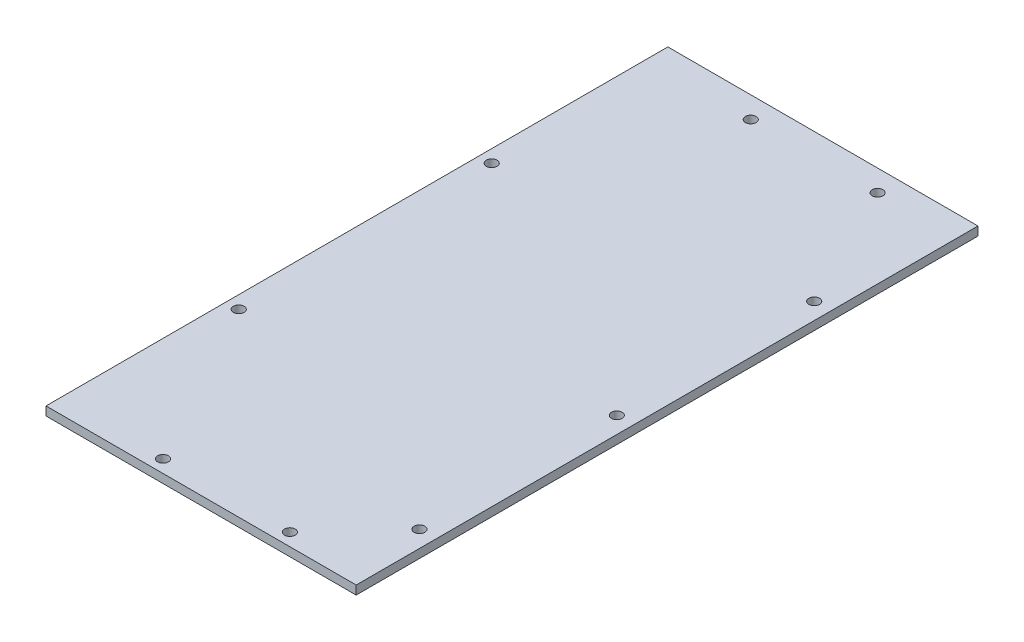
ISO-10303-21;
HEADER;
FILE_DESCRIPTION(('STEP AP214'),'2;1');
FILE_NAME('part.step','',(''),(''),'','','');
FILE_SCHEMA(('AUTOMOTIVE_DESIGN { 1 0 10303 214 1 1 1 1 }'));
ENDSEC;
DATA;
#1=APPLICATION_CONTEXT('core data for automotive mechanical design processes');
#2=APPLICATION_PROTOCOL_DEFINITION('international standard','automotive_design',2000,#1);
#3=PRODUCT_CONTEXT('',#1,'mechanical');
#4=PRODUCT('Part','Part','',(#3));
#5=PRODUCT_RELATED_PRODUCT_CATEGORY('part','',(#4));
#6=PRODUCT_DEFINITION_FORMATION('','',#4);
#7=PRODUCT_DEFINITION_CONTEXT('part definition',#1,'design');
#8=PRODUCT_DEFINITION('design','',#6,#7);
#9=PRODUCT_DEFINITION_SHAPE('','',#8);
#10=(LENGTH_UNIT() NAMED_UNIT(*) SI_UNIT(.MILLI.,.METRE.));
#11=(NAMED_UNIT(*) PLANE_ANGLE_UNIT() SI_UNIT($,.RADIAN.));
#12=(NAMED_UNIT(*) SI_UNIT($,.STERADIAN.) SOLID_ANGLE_UNIT());
#13=UNCERTAINTY_MEASURE_WITH_UNIT(LENGTH_MEASURE(1.E-05),#10,'distance_accuracy_value','');
#14=(GEOMETRIC_REPRESENTATION_CONTEXT(3) GLOBAL_UNCERTAINTY_ASSIGNED_CONTEXT((#13)) GLOBAL_UNIT_ASSIGNED_CONTEXT((#10,
#11,#12)) REPRESENTATION_CONTEXT('',''));
#15=CARTESIAN_POINT('',(0.,0.,0.));
#16=DIRECTION('',(0.,0.,1.));
#17=DIRECTION('',(1.,0.,0.));
#18=AXIS2_PLACEMENT_3D('',#15,#16,#17);
#19=CARTESIAN_POINT('',(55.,3.1,-110.26625));
#20=DIRECTION('',(-1.,0.,0.));
#21=DIRECTION('',(0.,0.,1.));
#22=AXIS2_PLACEMENT_3D('',#19,#20,#21);
#23=PLANE('',#22);
#24=DIRECTION('',(0.,0.,-1.));
#25=VECTOR('',#24,1.);
#26=CARTESIAN_POINT('',(55.,0.,-110.26625));
#27=LINE('',#26,#25);
#28=CARTESIAN_POINT('',(55.,0.,110.26625));
#29=VERTEX_POINT('',#28);
#30=CARTESIAN_POINT('',(55.,0.,-110.26625));
#31=VERTEX_POINT('',#30);
#32=EDGE_CURVE('E99',#29,#31,#27,.T.);
#33=ORIENTED_EDGE('',*,*,#32,.T.);
#34=DIRECTION('',(0.,-1.,0.));
#35=VECTOR('',#34,1.);
#36=CARTESIAN_POINT('',(55.,3.1,-110.26625));
#37=LINE('',#36,#35);
#38=CARTESIAN_POINT('',(55.,3.1,-110.26625));
#39=VERTEX_POINT('',#38);
#40=EDGE_CURVE('E11',#39,#31,#37,.T.);
#41=ORIENTED_EDGE('',*,*,#40,.F.);
#42=DIRECTION('',(0.,0.,-1.));
#43=VECTOR('',#42,1.);
#44=CARTESIAN_POINT('',(55.,3.1,-110.26625));
#45=LINE('',#44,#43);
#46=CARTESIAN_POINT('',(55.,3.1,110.26625));
#47=VERTEX_POINT('',#46);
#48=EDGE_CURVE('E87',#47,#39,#45,.T.);
#49=ORIENTED_EDGE('',*,*,#48,.F.);
#50=DIRECTION('',(0.,-1.,0.));
#51=VECTOR('',#50,1.);
#52=CARTESIAN_POINT('',(55.,3.1,110.26625));
#53=LINE('',#52,#51);
#54=EDGE_CURVE('E95',#47,#29,#53,.T.);
#55=ORIENTED_EDGE('',*,*,#54,.T.);
#56=EDGE_LOOP('',(#33,#41,#49,#55));
#57=FACE_BOUND('',#56,.T.);
#58=ADVANCED_FACE('F36',(#57),#23,.F.);
#59=CARTESIAN_POINT('',(-55.,3.1,-110.26625));
#60=DIRECTION('',(0.,0.,1.));
#61=DIRECTION('',(1.,0.,0.));
#62=AXIS2_PLACEMENT_3D('',#59,#60,#61);
#63=PLANE('',#62);
#64=DIRECTION('',(-1.,0.,0.));
#65=VECTOR('',#64,1.);
#66=CARTESIAN_POINT('',(-55.,0.,-110.26625));
#67=LINE('',#66,#65);
#68=CARTESIAN_POINT('',(-55.,0.,-110.26625));
#69=VERTEX_POINT('',#68);
#70=EDGE_CURVE('E91',#31,#69,#67,.T.);
#71=ORIENTED_EDGE('',*,*,#70,.T.);
#72=DIRECTION('',(0.,-1.,0.));
#73=VECTOR('',#72,1.);
#74=CARTESIAN_POINT('',(-55.,3.1,-110.26625));
#75=LINE('',#74,#73);
#76=CARTESIAN_POINT('',(-55.,3.1,-110.26625));
#77=VERTEX_POINT('',#76);
#78=EDGE_CURVE('E44',#77,#69,#75,.T.);
#79=ORIENTED_EDGE('',*,*,#78,.F.);
#80=DIRECTION('',(-1.,0.,0.));
#81=VECTOR('',#80,1.);
#82=CARTESIAN_POINT('',(-55.,3.1,-110.26625));
#83=LINE('',#82,#81);
#84=EDGE_CURVE('E82',#39,#77,#83,.T.);
#85=ORIENTED_EDGE('',*,*,#84,.F.);
#86=ORIENTED_EDGE('',*,*,#40,.T.);
#87=EDGE_LOOP('',(#71,#79,#85,#86));
#88=FACE_BOUND('',#87,.T.);
#89=ADVANCED_FACE('F90',(#88),#63,.F.);
#90=CARTESIAN_POINT('',(-55.,3.1,-110.26625));
#91=DIRECTION('',(1.,0.,0.));
#92=DIRECTION('',(0.,0.,-1.));
#93=AXIS2_PLACEMENT_3D('',#90,#91,#92);
#94=PLANE('',#93);
#95=DIRECTION('',(0.,0.,1.));
#96=VECTOR('',#95,1.);
#97=CARTESIAN_POINT('',(-55.,0.,-110.26625));
#98=LINE('',#97,#96);
#99=CARTESIAN_POINT('',(-55.,0.,110.26625));
#100=VERTEX_POINT('',#99);
#101=EDGE_CURVE('E69',#69,#100,#98,.T.);
#102=ORIENTED_EDGE('',*,*,#101,.T.);
#103=DIRECTION('',(0.,-1.,0.));
#104=VECTOR('',#103,1.);
#105=CARTESIAN_POINT('',(-55.,3.1,110.26625));
#106=LINE('',#105,#104);
#107=CARTESIAN_POINT('',(-55.,3.1,110.26625));
#108=VERTEX_POINT('',#107);
#109=EDGE_CURVE('E92',#108,#100,#106,.T.);
#110=ORIENTED_EDGE('',*,*,#109,.F.);
#111=DIRECTION('',(0.,0.,1.));
#112=VECTOR('',#111,1.);
#113=CARTESIAN_POINT('',(-55.,3.1,-110.26625));
#114=LINE('',#113,#112);
#115=EDGE_CURVE('E85',#77,#108,#114,.T.);
#116=ORIENTED_EDGE('',*,*,#115,.F.);
#117=ORIENTED_EDGE('',*,*,#78,.T.);
#118=EDGE_LOOP('',(#102,#110,#116,#117));
#119=FACE_BOUND('',#118,.T.);
#120=ADVANCED_FACE('F93',(#119),#94,.F.);
#121=CARTESIAN_POINT('',(-55.,3.1,110.26625));
#122=DIRECTION('',(0.,0.,-1.));
#123=DIRECTION('',(-1.,0.,0.));
#124=AXIS2_PLACEMENT_3D('',#121,#122,#123);
#125=PLANE('',#124);
#126=DIRECTION('',(1.,0.,0.));
#127=VECTOR('',#126,1.);
#128=CARTESIAN_POINT('',(-55.,0.,110.26625));
#129=LINE('',#128,#127);
#130=EDGE_CURVE('E75',#100,#29,#129,.T.);
#131=ORIENTED_EDGE('',*,*,#130,.T.);
#132=ORIENTED_EDGE('',*,*,#54,.F.);
#133=DIRECTION('',(1.,0.,0.));
#134=VECTOR('',#133,1.);
#135=CARTESIAN_POINT('',(-55.,3.1,110.26625));
#136=LINE('',#135,#134);
#137=EDGE_CURVE('E52',#108,#47,#136,.T.);
#138=ORIENTED_EDGE('',*,*,#137,.F.);
#139=ORIENTED_EDGE('',*,*,#109,.T.);
#140=EDGE_LOOP('',(#131,#132,#138,#139));
#141=FACE_BOUND('',#140,.T.);
#142=ADVANCED_FACE('F107',(#141),#125,.F.);
#143=CARTESIAN_POINT('',(0.,3.1,0.));
#144=DIRECTION('',(0.,1.,0.));
#145=DIRECTION('',(0.,0.,1.));
#146=AXIS2_PLACEMENT_3D('',#143,#144,#145);
#147=PLANE('',#146);
#148=CARTESIAN_POINT('',(27.0003,3.1,-102.66625));
#149=DIRECTION('',(0.,-1.,0.));
#150=DIRECTION('',(0.,0.,-1.));
#151=AXIS2_PLACEMENT_3D('',#148,#149,#150);
#152=CIRCLE('',#151,1.89865);
#153=CARTESIAN_POINT('',(27.0003,3.1,-104.5649));
#154=VERTEX_POINT('',#153);
#155=EDGE_CURVE('E160',#154,#154,#152,.T.);
#156=ORIENTED_EDGE('',*,*,#155,.T.);
#157=EDGE_LOOP('',(#156));
#158=FACE_BOUND('',#157,.T.);
#159=CARTESIAN_POINT('',(-17.9997,3.1,-102.66625));
#160=DIRECTION('',(0.,-1.,0.));
#161=DIRECTION('',(0.,0.,-1.));
#162=AXIS2_PLACEMENT_3D('',#159,#160,#161);
#163=CIRCLE('',#162,1.89865);
#164=CARTESIAN_POINT('',(-17.9997,3.1,-104.5649));
#165=VERTEX_POINT('',#164);
#166=EDGE_CURVE('E154',#165,#165,#163,.T.);
#167=ORIENTED_EDGE('',*,*,#166,.T.);
#168=EDGE_LOOP('',(#167));
#169=FACE_BOUND('',#168,.T.);
#170=CARTESIAN_POINT('',(27.0002999999999,3.1,105.77045));
#171=DIRECTION('',(0.,-1.,0.));
#172=DIRECTION('',(0.,0.,-1.));
#173=AXIS2_PLACEMENT_3D('',#170,#171,#172);
#174=CIRCLE('',#173,1.89865);
#175=CARTESIAN_POINT('',(27.0002999999999,3.1,103.8718));
#176=VERTEX_POINT('',#175);
#177=EDGE_CURVE('E148',#176,#176,#174,.T.);
#178=ORIENTED_EDGE('',*,*,#177,.T.);
#179=EDGE_LOOP('',(#178));
#180=FACE_BOUND('',#179,.T.);
#181=CARTESIAN_POINT('',(-17.9997,3.1,105.77045));
#182=DIRECTION('',(0.,-1.,0.));
#183=DIRECTION('',(0.,0.,-1.));
#184=AXIS2_PLACEMENT_3D('',#181,#182,#183);
#185=CIRCLE('',#184,1.89865);
#186=CARTESIAN_POINT('',(-17.9997,3.1,103.8718));
#187=VERTEX_POINT('',#186);
#188=EDGE_CURVE('E142',#187,#187,#185,.T.);
#189=ORIENTED_EDGE('',*,*,#188,.T.);
#190=EDGE_LOOP('',(#189));
#191=FACE_BOUND('',#190,.T.);
#192=CARTESIAN_POINT('',(49.0999999999999,3.1,-58.075));
#193=DIRECTION('',(0.,1.,0.));
#194=DIRECTION('',(0.,0.,1.));
#195=AXIS2_PLACEMENT_3D('',#192,#193,#194);
#196=CIRCLE('',#195,1.89864999999999);
#197=CARTESIAN_POINT('',(49.0999999999999,3.1,-56.17635));
#198=VERTEX_POINT('',#197);
#199=EDGE_CURVE('E139',#198,#198,#196,.T.);
#200=ORIENTED_EDGE('',*,*,#199,.F.);
#201=EDGE_LOOP('',(#200));
#202=FACE_BOUND('',#201,.T.);
#203=CARTESIAN_POINT('',(49.0999999999999,3.1,11.925));
#204=DIRECTION('',(0.,1.,0.));
#205=DIRECTION('',(0.,0.,1.));
#206=AXIS2_PLACEMENT_3D('',#203,#204,#205);
#207=CIRCLE('',#206,1.89864999999999);
#208=CARTESIAN_POINT('',(49.0999999999999,3.1,13.82365));
#209=VERTEX_POINT('',#208);
#210=EDGE_CURVE('E133',#209,#209,#207,.T.);
#211=ORIENTED_EDGE('',*,*,#210,.F.);
#212=EDGE_LOOP('',(#211));
#213=FACE_BOUND('',#212,.T.);
#214=CARTESIAN_POINT('',(49.0999999999999,3.1,81.925));
#215=DIRECTION('',(0.,1.,0.));
#216=DIRECTION('',(0.,0.,1.));
#217=AXIS2_PLACEMENT_3D('',#214,#215,#216);
#218=CIRCLE('',#217,1.89864999999999);
#219=CARTESIAN_POINT('',(49.0999999999999,3.1,83.82365));
#220=VERTEX_POINT('',#219);
#221=EDGE_CURVE('E127',#220,#220,#218,.T.);
#222=ORIENTED_EDGE('',*,*,#221,.F.);
#223=EDGE_LOOP('',(#222));
#224=FACE_BOUND('',#223,.T.);
#225=CARTESIAN_POINT('',(-50.4997,3.1,46.4112749999999));
#226=DIRECTION('',(0.,1.,0.));
#227=DIRECTION('',(0.,0.,1.));
#228=AXIS2_PLACEMENT_3D('',#225,#226,#227);
#229=CIRCLE('',#228,1.89864999999999);
#230=CARTESIAN_POINT('',(-50.4997,3.1,48.3099249999999));
#231=VERTEX_POINT('',#230);
#232=EDGE_CURVE('E121',#231,#231,#229,.T.);
#233=ORIENTED_EDGE('',*,*,#232,.F.);
#234=EDGE_LOOP('',(#233));
#235=FACE_BOUND('',#234,.T.);
#236=CARTESIAN_POINT('',(-50.4997,3.1,-43.3070750000001));
#237=DIRECTION('',(0.,1.,0.));
#238=DIRECTION('',(0.,0.,1.));
#239=AXIS2_PLACEMENT_3D('',#236,#237,#238);
#240=CIRCLE('',#239,1.89864999999999);
#241=CARTESIAN_POINT('',(-50.4997,3.1,-41.4084250000001));
#242=VERTEX_POINT('',#241);
#243=EDGE_CURVE('E115',#242,#242,#240,.T.);
#244=ORIENTED_EDGE('',*,*,#243,.F.);
#245=EDGE_LOOP('',(#244));
#246=FACE_BOUND('',#245,.T.);
#247=ORIENTED_EDGE('',*,*,#48,.T.);
#248=ORIENTED_EDGE('',*,*,#84,.T.);
#249=ORIENTED_EDGE('',*,*,#115,.T.);
#250=ORIENTED_EDGE('',*,*,#137,.T.);
#251=EDGE_LOOP('',(#247,#248,#249,#250));
#252=FACE_BOUND('',#251,.T.);
#253=ADVANCED_FACE('F83',(#158,#169,#180,#191,#202,#213,#224,#235,#246,#252),#147,.T.);
#254=CARTESIAN_POINT('',(0.,0.,0.));
#255=DIRECTION('',(0.,1.,0.));
#256=DIRECTION('',(0.,0.,1.));
#257=AXIS2_PLACEMENT_3D('',#254,#255,#256);
#258=PLANE('',#257);
#259=CARTESIAN_POINT('',(27.0003,0.,-102.66625));
#260=DIRECTION('',(0.,-1.,0.));
#261=DIRECTION('',(0.,0.,-1.));
#262=AXIS2_PLACEMENT_3D('',#259,#260,#261);
#263=CIRCLE('',#262,1.89865);
#264=CARTESIAN_POINT('',(27.0003,0.,-104.5649));
#265=VERTEX_POINT('',#264);
#266=EDGE_CURVE('E163',#265,#265,#263,.T.);
#267=ORIENTED_EDGE('',*,*,#266,.F.);
#268=EDGE_LOOP('',(#267));
#269=FACE_BOUND('',#268,.T.);
#270=CARTESIAN_POINT('',(-17.9997,0.,-102.66625));
#271=DIRECTION('',(0.,-1.,0.));
#272=DIRECTION('',(0.,0.,-1.));
#273=AXIS2_PLACEMENT_3D('',#270,#271,#272);
#274=CIRCLE('',#273,1.89865);
#275=CARTESIAN_POINT('',(-17.9997,0.,-104.5649));
#276=VERTEX_POINT('',#275);
#277=EDGE_CURVE('E157',#276,#276,#274,.T.);
#278=ORIENTED_EDGE('',*,*,#277,.F.);
#279=EDGE_LOOP('',(#278));
#280=FACE_BOUND('',#279,.T.);
#281=CARTESIAN_POINT('',(27.0002999999999,0.,105.77045));
#282=DIRECTION('',(0.,-1.,0.));
#283=DIRECTION('',(0.,0.,-1.));
#284=AXIS2_PLACEMENT_3D('',#281,#282,#283);
#285=CIRCLE('',#284,1.89865);
#286=CARTESIAN_POINT('',(27.0002999999999,0.,103.8718));
#287=VERTEX_POINT('',#286);
#288=EDGE_CURVE('E151',#287,#287,#285,.T.);
#289=ORIENTED_EDGE('',*,*,#288,.F.);
#290=EDGE_LOOP('',(#289));
#291=FACE_BOUND('',#290,.T.);
#292=CARTESIAN_POINT('',(-17.9997,0.,105.77045));
#293=DIRECTION('',(0.,-1.,0.));
#294=DIRECTION('',(0.,0.,-1.));
#295=AXIS2_PLACEMENT_3D('',#292,#293,#294);
#296=CIRCLE('',#295,1.89865);
#297=CARTESIAN_POINT('',(-17.9997,0.,103.8718));
#298=VERTEX_POINT('',#297);
#299=EDGE_CURVE('E145',#298,#298,#296,.T.);
#300=ORIENTED_EDGE('',*,*,#299,.F.);
#301=EDGE_LOOP('',(#300));
#302=FACE_BOUND('',#301,.T.);
#303=CARTESIAN_POINT('',(49.0999999999999,0.,-58.075));
#304=DIRECTION('',(0.,1.,0.));
#305=DIRECTION('',(0.,0.,1.));
#306=AXIS2_PLACEMENT_3D('',#303,#304,#305);
#307=CIRCLE('',#306,1.89865);
#308=CARTESIAN_POINT('',(49.0999999999999,0.,-56.17635));
#309=VERTEX_POINT('',#308);
#310=EDGE_CURVE('E136',#309,#309,#307,.T.);
#311=ORIENTED_EDGE('',*,*,#310,.T.);
#312=EDGE_LOOP('',(#311));
#313=FACE_BOUND('',#312,.T.);
#314=CARTESIAN_POINT('',(49.0999999999999,0.,11.925));
#315=DIRECTION('',(0.,1.,0.));
#316=DIRECTION('',(0.,0.,1.));
#317=AXIS2_PLACEMENT_3D('',#314,#315,#316);
#318=CIRCLE('',#317,1.89865);
#319=CARTESIAN_POINT('',(49.0999999999999,0.,13.82365));
#320=VERTEX_POINT('',#319);
#321=EDGE_CURVE('E130',#320,#320,#318,.T.);
#322=ORIENTED_EDGE('',*,*,#321,.T.);
#323=EDGE_LOOP('',(#322));
#324=FACE_BOUND('',#323,.T.);
#325=CARTESIAN_POINT('',(49.0999999999999,0.,81.925));
#326=DIRECTION('',(0.,1.,0.));
#327=DIRECTION('',(0.,0.,1.));
#328=AXIS2_PLACEMENT_3D('',#325,#326,#327);
#329=CIRCLE('',#328,1.89865);
#330=CARTESIAN_POINT('',(49.0999999999999,0.,83.82365));
#331=VERTEX_POINT('',#330);
#332=EDGE_CURVE('E124',#331,#331,#329,.T.);
#333=ORIENTED_EDGE('',*,*,#332,.T.);
#334=EDGE_LOOP('',(#333));
#335=FACE_BOUND('',#334,.T.);
#336=CARTESIAN_POINT('',(-50.4997,0.,46.4112749999999));
#337=DIRECTION('',(0.,1.,0.));
#338=DIRECTION('',(0.,0.,1.));
#339=AXIS2_PLACEMENT_3D('',#336,#337,#338);
#340=CIRCLE('',#339,1.89865);
#341=CARTESIAN_POINT('',(-50.4997,0.,48.309925));
#342=VERTEX_POINT('',#341);
#343=EDGE_CURVE('E118',#342,#342,#340,.T.);
#344=ORIENTED_EDGE('',*,*,#343,.T.);
#345=EDGE_LOOP('',(#344));
#346=FACE_BOUND('',#345,.T.);
#347=CARTESIAN_POINT('',(-50.4997,0.,-43.3070750000001));
#348=DIRECTION('',(0.,1.,0.));
#349=DIRECTION('',(0.,0.,1.));
#350=AXIS2_PLACEMENT_3D('',#347,#348,#349);
#351=CIRCLE('',#350,1.89865);
#352=CARTESIAN_POINT('',(-50.4997,0.,-41.4084250000001));
#353=VERTEX_POINT('',#352);
#354=EDGE_CURVE('E102',#353,#353,#351,.T.);
#355=ORIENTED_EDGE('',*,*,#354,.T.);
#356=EDGE_LOOP('',(#355));
#357=FACE_BOUND('',#356,.T.);
#358=ORIENTED_EDGE('',*,*,#32,.F.);
#359=ORIENTED_EDGE('',*,*,#130,.F.);
#360=ORIENTED_EDGE('',*,*,#101,.F.);
#361=ORIENTED_EDGE('',*,*,#70,.F.);
#362=EDGE_LOOP('',(#358,#359,#360,#361));
#363=FACE_BOUND('',#362,.T.);
#364=ADVANCED_FACE('F110',(#269,#280,#291,#302,#313,#324,#335,#346,#357,#363),#258,.F.);
#365=CARTESIAN_POINT('',(-50.4997,3.1,-43.3070750000001));
#366=DIRECTION('',(0.,1.,0.));
#367=DIRECTION('',(0.,0.,1.));
#368=AXIS2_PLACEMENT_3D('',#365,#366,#367);
#369=CYLINDRICAL_SURFACE('',#368,1.89864999999999);
#370=ORIENTED_EDGE('',*,*,#354,.F.);
#371=EDGE_LOOP('',(#370));
#372=FACE_BOUND('',#371,.T.);
#373=ORIENTED_EDGE('',*,*,#243,.T.);
#374=EDGE_LOOP('',(#373));
#375=FACE_BOUND('',#374,.T.);
#376=ADVANCED_FACE('F171',(#372,#375),#369,.F.);
#377=CARTESIAN_POINT('',(-50.4997,3.1,46.4112749999999));
#378=DIRECTION('',(0.,1.,0.));
#379=DIRECTION('',(0.,0.,1.));
#380=AXIS2_PLACEMENT_3D('',#377,#378,#379);
#381=CYLINDRICAL_SURFACE('',#380,1.89864999999999);
#382=ORIENTED_EDGE('',*,*,#343,.F.);
#383=EDGE_LOOP('',(#382));
#384=FACE_BOUND('',#383,.T.);
#385=ORIENTED_EDGE('',*,*,#232,.T.);
#386=EDGE_LOOP('',(#385));
#387=FACE_BOUND('',#386,.T.);
#388=ADVANCED_FACE('F191',(#384,#387),#381,.F.);
#389=CARTESIAN_POINT('',(49.0999999999999,3.1,81.925));
#390=DIRECTION('',(0.,1.,0.));
#391=DIRECTION('',(0.,0.,1.));
#392=AXIS2_PLACEMENT_3D('',#389,#390,#391);
#393=CYLINDRICAL_SURFACE('',#392,1.89864999999999);
#394=ORIENTED_EDGE('',*,*,#332,.F.);
#395=EDGE_LOOP('',(#394));
#396=FACE_BOUND('',#395,.T.);
#397=ORIENTED_EDGE('',*,*,#221,.T.);
#398=EDGE_LOOP('',(#397));
#399=FACE_BOUND('',#398,.T.);
#400=ADVANCED_FACE('F239',(#396,#399),#393,.F.);
#401=CARTESIAN_POINT('',(49.0999999999999,3.1,11.925));
#402=DIRECTION('',(0.,1.,0.));
#403=DIRECTION('',(0.,0.,1.));
#404=AXIS2_PLACEMENT_3D('',#401,#402,#403);
#405=CYLINDRICAL_SURFACE('',#404,1.89864999999999);
#406=ORIENTED_EDGE('',*,*,#321,.F.);
#407=EDGE_LOOP('',(#406));
#408=FACE_BOUND('',#407,.T.);
#409=ORIENTED_EDGE('',*,*,#210,.T.);
#410=EDGE_LOOP('',(#409));
#411=FACE_BOUND('',#410,.T.);
#412=ADVANCED_FACE('F247',(#408,#411),#405,.F.);
#413=CARTESIAN_POINT('',(49.0999999999999,3.1,-58.075));
#414=DIRECTION('',(0.,1.,0.));
#415=DIRECTION('',(0.,0.,1.));
#416=AXIS2_PLACEMENT_3D('',#413,#414,#415);
#417=CYLINDRICAL_SURFACE('',#416,1.89864999999999);
#418=ORIENTED_EDGE('',*,*,#310,.F.);
#419=EDGE_LOOP('',(#418));
#420=FACE_BOUND('',#419,.T.);
#421=ORIENTED_EDGE('',*,*,#199,.T.);
#422=EDGE_LOOP('',(#421));
#423=FACE_BOUND('',#422,.T.);
#424=ADVANCED_FACE('F255',(#420,#423),#417,.F.);
#425=CARTESIAN_POINT('',(-17.9997,0.,105.77045));
#426=DIRECTION('',(0.,-1.,0.));
#427=DIRECTION('',(0.,0.,-1.));
#428=AXIS2_PLACEMENT_3D('',#425,#426,#427);
#429=CYLINDRICAL_SURFACE('',#428,1.89865);
#430=ORIENTED_EDGE('',*,*,#188,.F.);
#431=EDGE_LOOP('',(#430));
#432=FACE_BOUND('',#431,.T.);
#433=ORIENTED_EDGE('',*,*,#299,.T.);
#434=EDGE_LOOP('',(#433));
#435=FACE_BOUND('',#434,.T.);
#436=ADVANCED_FACE('F262',(#432,#435),#429,.F.);
#437=CARTESIAN_POINT('',(27.0002999999999,0.,105.77045));
#438=DIRECTION('',(0.,-1.,0.));
#439=DIRECTION('',(0.,0.,-1.));
#440=AXIS2_PLACEMENT_3D('',#437,#438,#439);
#441=CYLINDRICAL_SURFACE('',#440,1.89865);
#442=ORIENTED_EDGE('',*,*,#177,.F.);
#443=EDGE_LOOP('',(#442));
#444=FACE_BOUND('',#443,.T.);
#445=ORIENTED_EDGE('',*,*,#288,.T.);
#446=EDGE_LOOP('',(#445));
#447=FACE_BOUND('',#446,.T.);
#448=ADVANCED_FACE('F269',(#444,#447),#441,.F.);
#449=CARTESIAN_POINT('',(-17.9997,0.,-102.66625));
#450=DIRECTION('',(0.,-1.,0.));
#451=DIRECTION('',(0.,0.,-1.));
#452=AXIS2_PLACEMENT_3D('',#449,#450,#451);
#453=CYLINDRICAL_SURFACE('',#452,1.89865);
#454=ORIENTED_EDGE('',*,*,#166,.F.);
#455=EDGE_LOOP('',(#454));
#456=FACE_BOUND('',#455,.T.);
#457=ORIENTED_EDGE('',*,*,#277,.T.);
#458=EDGE_LOOP('',(#457));
#459=FACE_BOUND('',#458,.T.);
#460=ADVANCED_FACE('F277',(#456,#459),#453,.F.);
#461=CARTESIAN_POINT('',(27.0003,0.,-102.66625));
#462=DIRECTION('',(0.,-1.,0.));
#463=DIRECTION('',(0.,0.,-1.));
#464=AXIS2_PLACEMENT_3D('',#461,#462,#463);
#465=CYLINDRICAL_SURFACE('',#464,1.89865);
#466=ORIENTED_EDGE('',*,*,#155,.F.);
#467=EDGE_LOOP('',(#466));
#468=FACE_BOUND('',#467,.T.);
#469=ORIENTED_EDGE('',*,*,#266,.T.);
#470=EDGE_LOOP('',(#469));
#471=FACE_BOUND('',#470,.T.);
#472=ADVANCED_FACE('F167',(#468,#471),#465,.F.);
#473=CLOSED_SHELL('',(#58,#89,#120,#142,#253,#364,#376,#388,#400,#412,#424,#436,#448,#460,#472));
#474=MANIFOLD_SOLID_BREP('B2',#473);
#475=ADVANCED_BREP_SHAPE_REPRESENTATION('',(#18,#474),#14);
#476=SHAPE_DEFINITION_REPRESENTATION(#9,#475);
ENDSEC;
END-ISO-10303-21;
